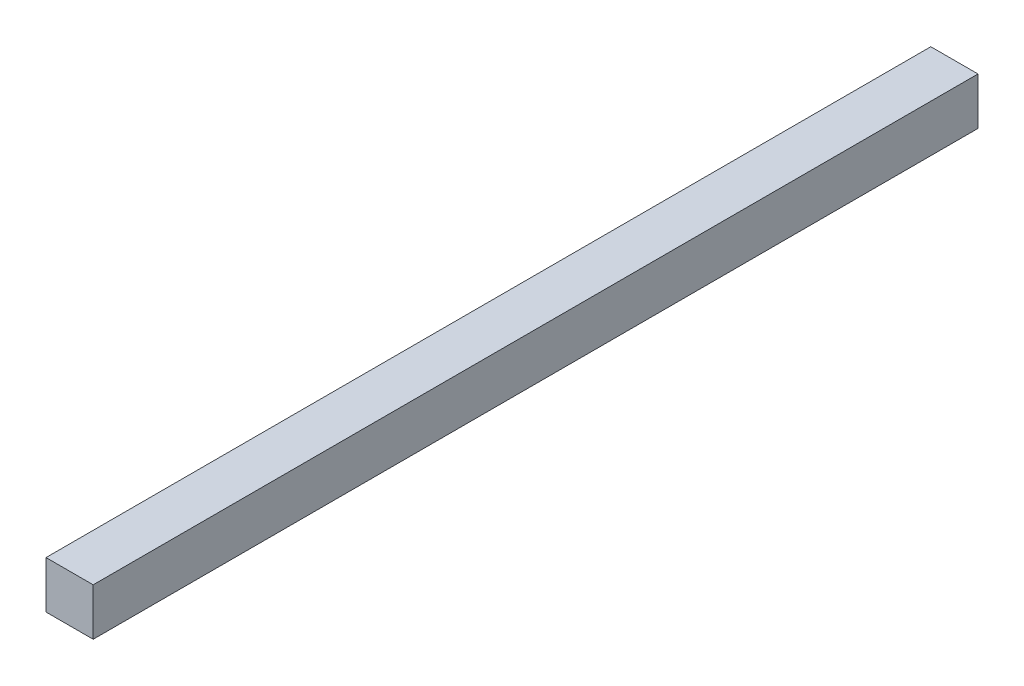
ISO-10303-21;
HEADER;
FILE_DESCRIPTION(('STEP AP214'),'2;1');
FILE_NAME('part.step','',(''),(''),'','','');
FILE_SCHEMA(('AUTOMOTIVE_DESIGN { 1 0 10303 214 1 1 1 1 }'));
ENDSEC;
DATA;
#1=APPLICATION_CONTEXT('core data for automotive mechanical design processes');
#2=APPLICATION_PROTOCOL_DEFINITION('international standard','automotive_design',2000,#1);
#3=PRODUCT_CONTEXT('',#1,'mechanical');
#4=PRODUCT('Part','Part','',(#3));
#5=PRODUCT_RELATED_PRODUCT_CATEGORY('part','',(#4));
#6=PRODUCT_DEFINITION_FORMATION('','',#4);
#7=PRODUCT_DEFINITION_CONTEXT('part definition',#1,'design');
#8=PRODUCT_DEFINITION('design','',#6,#7);
#9=PRODUCT_DEFINITION_SHAPE('','',#8);
#10=(LENGTH_UNIT() NAMED_UNIT(*) SI_UNIT(.MILLI.,.METRE.));
#11=(NAMED_UNIT(*) PLANE_ANGLE_UNIT() SI_UNIT($,.RADIAN.));
#12=(NAMED_UNIT(*) SI_UNIT($,.STERADIAN.) SOLID_ANGLE_UNIT());
#13=UNCERTAINTY_MEASURE_WITH_UNIT(LENGTH_MEASURE(1.E-05),#10,'distance_accuracy_value','');
#14=(GEOMETRIC_REPRESENTATION_CONTEXT(3) GLOBAL_UNCERTAINTY_ASSIGNED_CONTEXT((#13)) GLOBAL_UNIT_ASSIGNED_CONTEXT((#10,
#11,#12)) REPRESENTATION_CONTEXT('',''));
#15=CARTESIAN_POINT('',(0.,0.,0.));
#16=DIRECTION('',(0.,0.,1.));
#17=DIRECTION('',(1.,0.,0.));
#18=AXIS2_PLACEMENT_3D('',#15,#16,#17);
#19=CARTESIAN_POINT('',(0.,0.,-375.));
#20=DIRECTION('',(-1.,0.,0.));
#21=DIRECTION('',(0.,0.,1.));
#22=AXIS2_PLACEMENT_3D('',#19,#20,#21);
#23=PLANE('',#22);
#24=DIRECTION('',(0.,-1.,0.));
#25=VECTOR('',#24,1.);
#26=CARTESIAN_POINT('',(0.,0.,0.));
#27=LINE('',#26,#25);
#28=CARTESIAN_POINT('',(0.,20.,0.));
#29=VERTEX_POINT('',#28);
#30=CARTESIAN_POINT('',(0.,0.,0.));
#31=VERTEX_POINT('',#30);
#32=EDGE_CURVE('E97',#29,#31,#27,.T.);
#33=ORIENTED_EDGE('',*,*,#32,.F.);
#34=DIRECTION('',(0.,0.,1.));
#35=VECTOR('',#34,1.);
#36=CARTESIAN_POINT('',(0.,20.,-375.));
#37=LINE('',#36,#35);
#38=CARTESIAN_POINT('',(0.,20.,-375.));
#39=VERTEX_POINT('',#38);
#40=EDGE_CURVE('E11',#39,#29,#37,.T.);
#41=ORIENTED_EDGE('',*,*,#40,.F.);
#42=DIRECTION('',(0.,-1.,0.));
#43=VECTOR('',#42,1.);
#44=CARTESIAN_POINT('',(0.,0.,-375.));
#45=LINE('',#44,#43);
#46=CARTESIAN_POINT('',(0.,0.,-375.));
#47=VERTEX_POINT('',#46);
#48=EDGE_CURVE('E91',#39,#47,#45,.T.);
#49=ORIENTED_EDGE('',*,*,#48,.T.);
#50=DIRECTION('',(0.,0.,1.));
#51=VECTOR('',#50,1.);
#52=CARTESIAN_POINT('',(0.,0.,-375.));
#53=LINE('',#52,#51);
#54=EDGE_CURVE('E36',#47,#31,#53,.T.);
#55=ORIENTED_EDGE('',*,*,#54,.T.);
#56=EDGE_LOOP('',(#33,#41,#49,#55));
#57=FACE_BOUND('',#56,.T.);
#58=ADVANCED_FACE('F33',(#57),#23,.T.);
#59=CARTESIAN_POINT('',(0.,20.,-375.));
#60=DIRECTION('',(0.,1.,0.));
#61=DIRECTION('',(0.,0.,1.));
#62=AXIS2_PLACEMENT_3D('',#59,#60,#61);
#63=PLANE('',#62);
#64=DIRECTION('',(-1.,0.,0.));
#65=VECTOR('',#64,1.);
#66=CARTESIAN_POINT('',(0.,20.,0.));
#67=LINE('',#66,#65);
#68=CARTESIAN_POINT('',(20.,20.,0.));
#69=VERTEX_POINT('',#68);
#70=EDGE_CURVE('E93',#69,#29,#67,.T.);
#71=ORIENTED_EDGE('',*,*,#70,.F.);
#72=DIRECTION('',(0.,0.,1.));
#73=VECTOR('',#72,1.);
#74=CARTESIAN_POINT('',(20.,20.,-375.));
#75=LINE('',#74,#73);
#76=CARTESIAN_POINT('',(20.,20.,-375.));
#77=VERTEX_POINT('',#76);
#78=EDGE_CURVE('E42',#77,#69,#75,.T.);
#79=ORIENTED_EDGE('',*,*,#78,.F.);
#80=DIRECTION('',(-1.,0.,0.));
#81=VECTOR('',#80,1.);
#82=CARTESIAN_POINT('',(0.,20.,-375.));
#83=LINE('',#82,#81);
#84=EDGE_CURVE('E88',#77,#39,#83,.T.);
#85=ORIENTED_EDGE('',*,*,#84,.T.);
#86=ORIENTED_EDGE('',*,*,#40,.T.);
#87=EDGE_LOOP('',(#71,#79,#85,#86));
#88=FACE_BOUND('',#87,.T.);
#89=ADVANCED_FACE('F107',(#88),#63,.T.);
#90=CARTESIAN_POINT('',(20.,0.,-375.));
#91=DIRECTION('',(1.,0.,0.));
#92=DIRECTION('',(0.,0.,-1.));
#93=AXIS2_PLACEMENT_3D('',#90,#91,#92);
#94=PLANE('',#93);
#95=DIRECTION('',(0.,1.,0.));
#96=VECTOR('',#95,1.);
#97=CARTESIAN_POINT('',(20.,0.,0.));
#98=LINE('',#97,#96);
#99=CARTESIAN_POINT('',(20.,0.,0.));
#100=VERTEX_POINT('',#99);
#101=EDGE_CURVE('E83',#100,#69,#98,.T.);
#102=ORIENTED_EDGE('',*,*,#101,.F.);
#103=DIRECTION('',(0.,0.,1.));
#104=VECTOR('',#103,1.);
#105=CARTESIAN_POINT('',(20.,0.,-375.));
#106=LINE('',#105,#104);
#107=CARTESIAN_POINT('',(20.,0.,-375.));
#108=VERTEX_POINT('',#107);
#109=EDGE_CURVE('E78',#108,#100,#106,.T.);
#110=ORIENTED_EDGE('',*,*,#109,.F.);
#111=DIRECTION('',(0.,1.,0.));
#112=VECTOR('',#111,1.);
#113=CARTESIAN_POINT('',(20.,0.,-375.));
#114=LINE('',#113,#112);
#115=EDGE_CURVE('E81',#108,#77,#114,.T.);
#116=ORIENTED_EDGE('',*,*,#115,.T.);
#117=ORIENTED_EDGE('',*,*,#78,.T.);
#118=EDGE_LOOP('',(#102,#110,#116,#117));
#119=FACE_BOUND('',#118,.T.);
#120=ADVANCED_FACE('F80',(#119),#94,.T.);
#121=CARTESIAN_POINT('',(0.,0.,-375.));
#122=DIRECTION('',(0.,-1.,0.));
#123=DIRECTION('',(0.,0.,-1.));
#124=AXIS2_PLACEMENT_3D('',#121,#122,#123);
#125=PLANE('',#124);
#126=DIRECTION('',(1.,0.,0.));
#127=VECTOR('',#126,1.);
#128=CARTESIAN_POINT('',(0.,0.,0.));
#129=LINE('',#128,#127);
#130=EDGE_CURVE('E100',#31,#100,#129,.T.);
#131=ORIENTED_EDGE('',*,*,#130,.F.);
#132=ORIENTED_EDGE('',*,*,#54,.F.);
#133=DIRECTION('',(1.,0.,0.));
#134=VECTOR('',#133,1.);
#135=CARTESIAN_POINT('',(0.,0.,-375.));
#136=LINE('',#135,#134);
#137=EDGE_CURVE('E87',#47,#108,#136,.T.);
#138=ORIENTED_EDGE('',*,*,#137,.T.);
#139=ORIENTED_EDGE('',*,*,#109,.T.);
#140=EDGE_LOOP('',(#131,#132,#138,#139));
#141=FACE_BOUND('',#140,.T.);
#142=ADVANCED_FACE('F90',(#141),#125,.T.);
#143=CARTESIAN_POINT('',(0.,0.,-375.));
#144=DIRECTION('',(0.,0.,-1.));
#145=DIRECTION('',(-1.,0.,0.));
#146=AXIS2_PLACEMENT_3D('',#143,#144,#145);
#147=PLANE('',#146);
#148=ORIENTED_EDGE('',*,*,#48,.F.);
#149=ORIENTED_EDGE('',*,*,#84,.F.);
#150=ORIENTED_EDGE('',*,*,#115,.F.);
#151=ORIENTED_EDGE('',*,*,#137,.F.);
#152=EDGE_LOOP('',(#148,#149,#150,#151));
#153=FACE_BOUND('',#152,.T.);
#154=ADVANCED_FACE('F86',(#153),#147,.T.);
#155=CARTESIAN_POINT('',(0.,0.,0.));
#156=DIRECTION('',(0.,0.,-1.));
#157=DIRECTION('',(-1.,0.,0.));
#158=AXIS2_PLACEMENT_3D('',#155,#156,#157);
#159=PLANE('',#158);
#160=ORIENTED_EDGE('',*,*,#32,.T.);
#161=ORIENTED_EDGE('',*,*,#130,.T.);
#162=ORIENTED_EDGE('',*,*,#101,.T.);
#163=ORIENTED_EDGE('',*,*,#70,.T.);
#164=EDGE_LOOP('',(#160,#161,#162,#163));
#165=FACE_BOUND('',#164,.T.);
#166=ADVANCED_FACE('F106',(#165),#159,.F.);
#167=CLOSED_SHELL('',(#58,#89,#120,#142,#154,#166));
#168=MANIFOLD_SOLID_BREP('B2',#167);
#169=ADVANCED_BREP_SHAPE_REPRESENTATION('',(#18,#168),#14);
#170=SHAPE_DEFINITION_REPRESENTATION(#9,#169);
ENDSEC;
END-ISO-10303-21;
